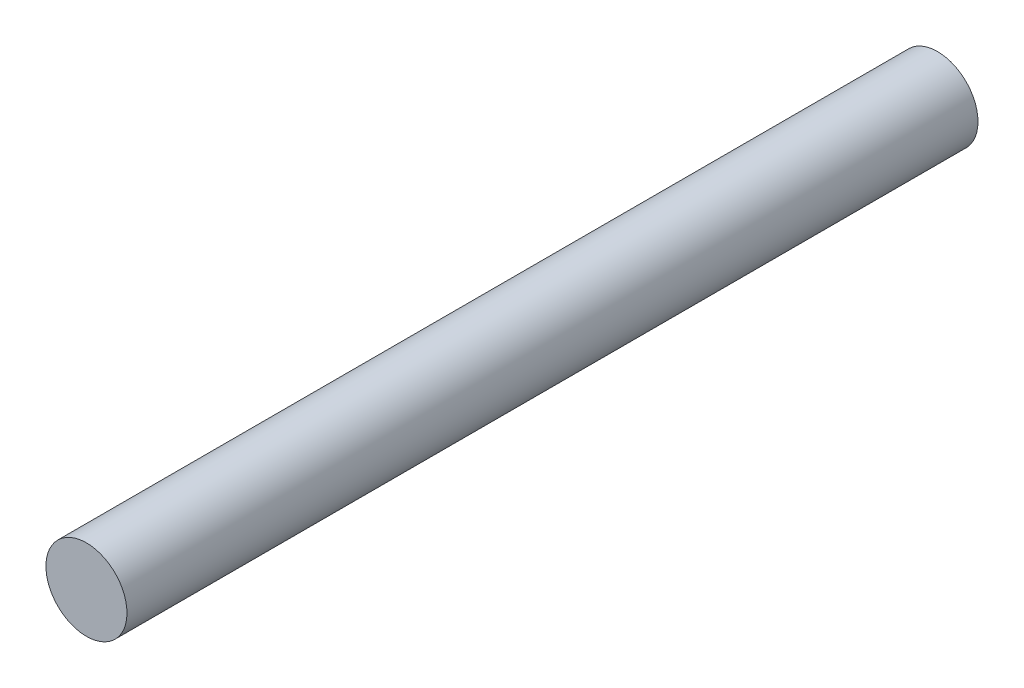
ISO-10303-21;
HEADER;
FILE_DESCRIPTION(('STEP AP214'),'2;1');
FILE_NAME('part.step','',(''),(''),'','','');
FILE_SCHEMA(('AUTOMOTIVE_DESIGN { 1 0 10303 214 1 1 1 1 }'));
ENDSEC;
DATA;
#1=APPLICATION_CONTEXT('core data for automotive mechanical design processes');
#2=APPLICATION_PROTOCOL_DEFINITION('international standard','automotive_design',2000,#1);
#3=PRODUCT_CONTEXT('',#1,'mechanical');
#4=PRODUCT('Part','Part','',(#3));
#5=PRODUCT_RELATED_PRODUCT_CATEGORY('part','',(#4));
#6=PRODUCT_DEFINITION_FORMATION('','',#4);
#7=PRODUCT_DEFINITION_CONTEXT('part definition',#1,'design');
#8=PRODUCT_DEFINITION('design','',#6,#7);
#9=PRODUCT_DEFINITION_SHAPE('','',#8);
#10=(LENGTH_UNIT() NAMED_UNIT(*) SI_UNIT(.MILLI.,.METRE.));
#11=(NAMED_UNIT(*) PLANE_ANGLE_UNIT() SI_UNIT($,.RADIAN.));
#12=(NAMED_UNIT(*) SI_UNIT($,.STERADIAN.) SOLID_ANGLE_UNIT());
#13=UNCERTAINTY_MEASURE_WITH_UNIT(LENGTH_MEASURE(1.E-05),#10,'distance_accuracy_value','');
#14=(GEOMETRIC_REPRESENTATION_CONTEXT(3) GLOBAL_UNCERTAINTY_ASSIGNED_CONTEXT((#13)) GLOBAL_UNIT_ASSIGNED_CONTEXT((#10,
#11,#12)) REPRESENTATION_CONTEXT('',''));
#15=CARTESIAN_POINT('',(0.,0.,0.));
#16=DIRECTION('',(0.,0.,1.));
#17=DIRECTION('',(1.,0.,0.));
#18=AXIS2_PLACEMENT_3D('',#15,#16,#17);
#19=CARTESIAN_POINT('',(0.,0.,84.));
#20=DIRECTION('',(0.,0.,-1.));
#21=DIRECTION('',(-1.,0.,0.));
#22=AXIS2_PLACEMENT_3D('',#19,#20,#21);
#23=CYLINDRICAL_SURFACE('',#22,4.);
#24=CARTESIAN_POINT('',(0.,0.,84.));
#25=DIRECTION('',(0.,0.,1.));
#26=DIRECTION('',(1.,0.,0.));
#27=AXIS2_PLACEMENT_3D('',#24,#25,#26);
#28=CIRCLE('',#27,4.);
#29=CARTESIAN_POINT('',(4.,0.,84.));
#30=VERTEX_POINT('',#29);
#31=EDGE_CURVE('E10',#30,#30,#28,.T.);
#32=ORIENTED_EDGE('',*,*,#31,.F.);
#33=EDGE_LOOP('',(#32));
#34=FACE_BOUND('',#33,.T.);
#35=CARTESIAN_POINT('',(0.,0.,0.));
#36=DIRECTION('',(0.,0.,1.));
#37=DIRECTION('',(1.,0.,0.));
#38=AXIS2_PLACEMENT_3D('',#35,#36,#37);
#39=CIRCLE('',#38,4.);
#40=CARTESIAN_POINT('',(4.,0.,0.));
#41=VERTEX_POINT('',#40);
#42=EDGE_CURVE('E33',#41,#41,#39,.T.);
#43=ORIENTED_EDGE('',*,*,#42,.T.);
#44=EDGE_LOOP('',(#43));
#45=FACE_BOUND('',#44,.T.);
#46=ADVANCED_FACE('F30',(#34,#45),#23,.T.);
#47=CARTESIAN_POINT('',(0.,0.,84.));
#48=DIRECTION('',(0.,0.,1.));
#49=DIRECTION('',(1.,0.,0.));
#50=AXIS2_PLACEMENT_3D('',#47,#48,#49);
#51=PLANE('',#50);
#52=ORIENTED_EDGE('',*,*,#31,.T.);
#53=EDGE_LOOP('',(#52));
#54=FACE_BOUND('',#53,.T.);
#55=ADVANCED_FACE('F45',(#54),#51,.T.);
#56=CARTESIAN_POINT('',(0.,0.,0.));
#57=DIRECTION('',(0.,0.,1.));
#58=DIRECTION('',(1.,0.,0.));
#59=AXIS2_PLACEMENT_3D('',#56,#57,#58);
#60=PLANE('',#59);
#61=ORIENTED_EDGE('',*,*,#42,.F.);
#62=EDGE_LOOP('',(#61));
#63=FACE_BOUND('',#62,.T.);
#64=ADVANCED_FACE('F43',(#63),#60,.F.);
#65=CLOSED_SHELL('',(#46,#55,#64));
#66=MANIFOLD_SOLID_BREP('B2',#65);
#67=ADVANCED_BREP_SHAPE_REPRESENTATION('',(#18,#66),#14);
#68=SHAPE_DEFINITION_REPRESENTATION(#9,#67);
ENDSEC;
END-ISO-10303-21;
